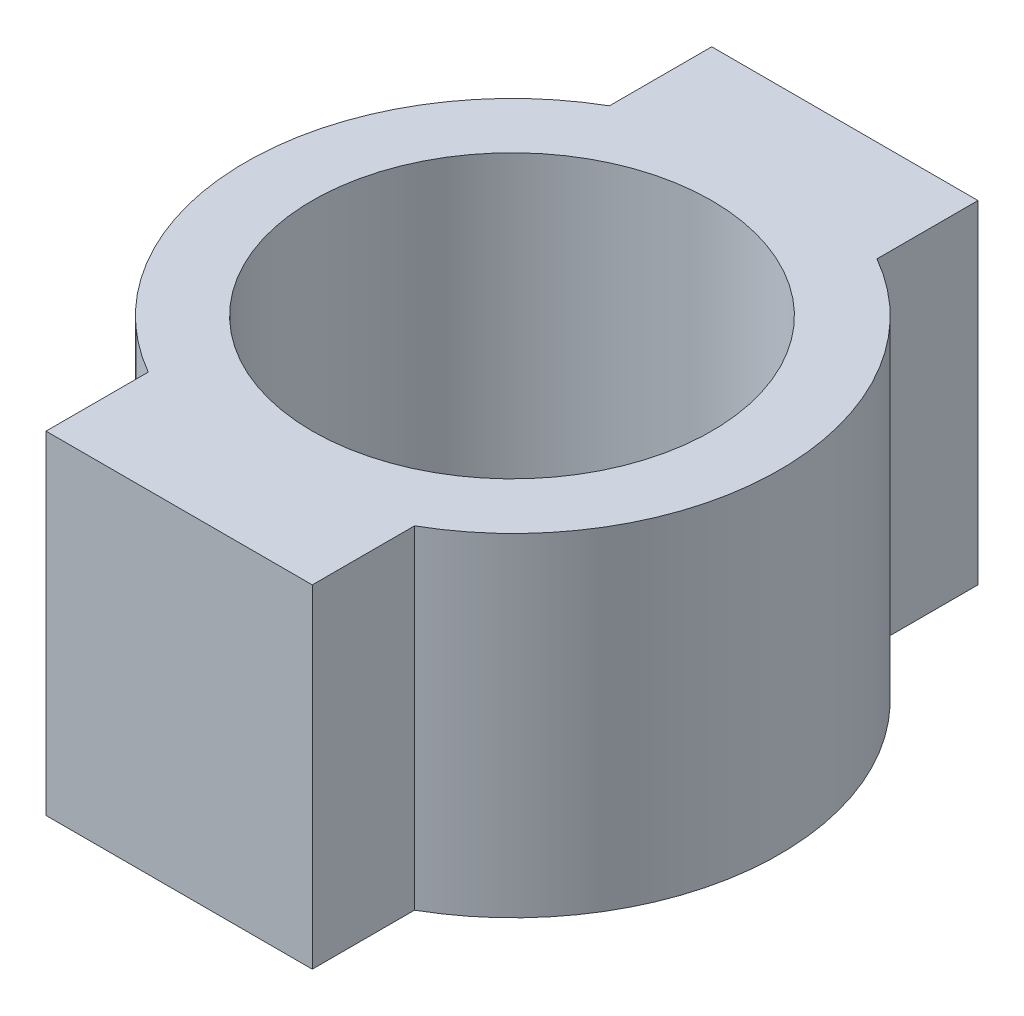
ISO-10303-21;
HEADER;
FILE_DESCRIPTION(('STEP AP214'),'2;1');
FILE_NAME('part.step','',(''),(''),'','','');
FILE_SCHEMA(('AUTOMOTIVE_DESIGN { 1 0 10303 214 1 1 1 1 }'));
ENDSEC;
DATA;
#1=APPLICATION_CONTEXT('core data for automotive mechanical design processes');
#2=APPLICATION_PROTOCOL_DEFINITION('international standard','automotive_design',2000,#1);
#3=PRODUCT_CONTEXT('',#1,'mechanical');
#4=PRODUCT('Part','Part','',(#3));
#5=PRODUCT_RELATED_PRODUCT_CATEGORY('part','',(#4));
#6=PRODUCT_DEFINITION_FORMATION('','',#4);
#7=PRODUCT_DEFINITION_CONTEXT('part definition',#1,'design');
#8=PRODUCT_DEFINITION('design','',#6,#7);
#9=PRODUCT_DEFINITION_SHAPE('','',#8);
#10=(LENGTH_UNIT() NAMED_UNIT(*) SI_UNIT(.MILLI.,.METRE.));
#11=(NAMED_UNIT(*) PLANE_ANGLE_UNIT() SI_UNIT($,.RADIAN.));
#12=(NAMED_UNIT(*) SI_UNIT($,.STERADIAN.) SOLID_ANGLE_UNIT());
#13=UNCERTAINTY_MEASURE_WITH_UNIT(LENGTH_MEASURE(1.E-05),#10,'distance_accuracy_value','');
#14=(GEOMETRIC_REPRESENTATION_CONTEXT(3) GLOBAL_UNCERTAINTY_ASSIGNED_CONTEXT((#13)) GLOBAL_UNIT_ASSIGNED_CONTEXT((#10,
#11,#12)) REPRESENTATION_CONTEXT('',''));
#15=CARTESIAN_POINT('',(0.,0.,0.));
#16=DIRECTION('',(0.,0.,1.));
#17=DIRECTION('',(1.,0.,0.));
#18=AXIS2_PLACEMENT_3D('',#15,#16,#17);
#19=CARTESIAN_POINT('',(20.,50.,-50.));
#20=DIRECTION('',(1.,0.,0.));
#21=DIRECTION('',(0.,0.,-1.));
#22=AXIS2_PLACEMENT_3D('',#19,#20,#21);
#23=PLANE('',#22);
#24=DIRECTION('',(0.,0.,1.));
#25=VECTOR('',#24,1.);
#26=CARTESIAN_POINT('',(20.,0.,-50.));
#27=LINE('',#26,#25);
#28=CARTESIAN_POINT('',(20.,0.,-50.));
#29=VERTEX_POINT('',#28);
#30=CARTESIAN_POINT('',(20.,0.,-34.8186230637616));
#31=VERTEX_POINT('',#30);
#32=EDGE_CURVE('E134',#29,#31,#27,.T.);
#33=ORIENTED_EDGE('',*,*,#32,.F.);
#34=DIRECTION('',(0.,-1.,0.));
#35=VECTOR('',#34,1.);
#36=CARTESIAN_POINT('',(20.,50.,-50.));
#37=LINE('',#36,#35);
#38=CARTESIAN_POINT('',(20.,50.,-50.));
#39=VERTEX_POINT('',#38);
#40=EDGE_CURVE('E11',#39,#29,#37,.T.);
#41=ORIENTED_EDGE('',*,*,#40,.F.);
#42=DIRECTION('',(0.,0.,1.));
#43=VECTOR('',#42,1.);
#44=CARTESIAN_POINT('',(20.,50.,-50.));
#45=LINE('',#44,#43);
#46=CARTESIAN_POINT('',(20.,50.,-34.8186230637616));
#47=VERTEX_POINT('',#46);
#48=EDGE_CURVE('E154',#39,#47,#45,.T.);
#49=ORIENTED_EDGE('',*,*,#48,.T.);
#50=DIRECTION('',(0.,-1.,0.));
#51=VECTOR('',#50,1.);
#52=CARTESIAN_POINT('',(20.,50.,-34.8186230637616));
#53=LINE('',#52,#51);
#54=EDGE_CURVE('E40',#47,#31,#53,.T.);
#55=ORIENTED_EDGE('',*,*,#54,.T.);
#56=EDGE_LOOP('',(#33,#41,#49,#55));
#57=FACE_BOUND('',#56,.T.);
#58=ADVANCED_FACE('F37',(#57),#23,.T.);
#59=CARTESIAN_POINT('',(-20.,50.,-50.));
#60=DIRECTION('',(0.,0.,-1.));
#61=DIRECTION('',(-1.,0.,0.));
#62=AXIS2_PLACEMENT_3D('',#59,#60,#61);
#63=PLANE('',#62);
#64=DIRECTION('',(1.,0.,0.));
#65=VECTOR('',#64,1.);
#66=CARTESIAN_POINT('',(-20.,0.,-50.));
#67=LINE('',#66,#65);
#68=CARTESIAN_POINT('',(-20.,0.,-50.));
#69=VERTEX_POINT('',#68);
#70=EDGE_CURVE('E152',#69,#29,#67,.T.);
#71=ORIENTED_EDGE('',*,*,#70,.F.);
#72=DIRECTION('',(0.,-1.,0.));
#73=VECTOR('',#72,1.);
#74=CARTESIAN_POINT('',(-20.,50.,-50.));
#75=LINE('',#74,#73);
#76=CARTESIAN_POINT('',(-20.,50.,-50.));
#77=VERTEX_POINT('',#76);
#78=EDGE_CURVE('E46',#77,#69,#75,.T.);
#79=ORIENTED_EDGE('',*,*,#78,.F.);
#80=DIRECTION('',(1.,0.,0.));
#81=VECTOR('',#80,1.);
#82=CARTESIAN_POINT('',(-20.,50.,-50.));
#83=LINE('',#82,#81);
#84=EDGE_CURVE('E114',#77,#39,#83,.T.);
#85=ORIENTED_EDGE('',*,*,#84,.T.);
#86=ORIENTED_EDGE('',*,*,#40,.T.);
#87=EDGE_LOOP('',(#71,#79,#85,#86));
#88=FACE_BOUND('',#87,.T.);
#89=ADVANCED_FACE('F168',(#88),#63,.T.);
#90=CARTESIAN_POINT('',(-20.,50.,-50.));
#91=DIRECTION('',(1.,0.,0.));
#92=DIRECTION('',(0.,0.,-1.));
#93=AXIS2_PLACEMENT_3D('',#90,#91,#92);
#94=PLANE('',#93);
#95=DIRECTION('',(0.,0.,1.));
#96=VECTOR('',#95,1.);
#97=CARTESIAN_POINT('',(-20.,0.,-50.));
#98=LINE('',#97,#96);
#99=CARTESIAN_POINT('',(-20.,0.,-34.6410161513776));
#100=VERTEX_POINT('',#99);
#101=EDGE_CURVE('E119',#69,#100,#98,.T.);
#102=ORIENTED_EDGE('',*,*,#101,.T.);
#103=DIRECTION('',(0.,-1.,0.));
#104=VECTOR('',#103,1.);
#105=CARTESIAN_POINT('',(-20.,50.,-34.6410161513776));
#106=LINE('',#105,#104);
#107=CARTESIAN_POINT('',(-20.,50.,-34.6410161513776));
#108=VERTEX_POINT('',#107);
#109=EDGE_CURVE('E117',#108,#100,#106,.T.);
#110=ORIENTED_EDGE('',*,*,#109,.F.);
#111=DIRECTION('',(0.,0.,1.));
#112=VECTOR('',#111,1.);
#113=CARTESIAN_POINT('',(-20.,50.,-50.));
#114=LINE('',#113,#112);
#115=EDGE_CURVE('E107',#77,#108,#114,.T.);
#116=ORIENTED_EDGE('',*,*,#115,.F.);
#117=ORIENTED_EDGE('',*,*,#78,.T.);
#118=EDGE_LOOP('',(#102,#110,#116,#117));
#119=FACE_BOUND('',#118,.T.);
#120=ADVANCED_FACE('F118',(#119),#94,.F.);
#121=CARTESIAN_POINT('',(0.,50.,0.));
#122=DIRECTION('',(0.,-1.,0.));
#123=DIRECTION('',(0.,0.,-1.));
#124=AXIS2_PLACEMENT_3D('',#121,#122,#123);
#125=CYLINDRICAL_SURFACE('',#124,40.);
#126=CARTESIAN_POINT('',(0.,0.,0.));
#127=DIRECTION('',(0.,1.,0.));
#128=DIRECTION('',(0.,0.,1.));
#129=AXIS2_PLACEMENT_3D('',#126,#127,#128);
#130=CIRCLE('',#129,40.);
#131=CARTESIAN_POINT('',(-20.,0.,34.6410161513775));
#132=VERTEX_POINT('',#131);
#133=EDGE_CURVE('E149',#100,#132,#130,.T.);
#134=ORIENTED_EDGE('',*,*,#133,.T.);
#135=DIRECTION('',(0.,-1.,0.));
#136=VECTOR('',#135,1.);
#137=CARTESIAN_POINT('',(-20.,50.,34.6410161513775));
#138=LINE('',#137,#136);
#139=CARTESIAN_POINT('',(-20.,50.,34.6410161513775));
#140=VERTEX_POINT('',#139);
#141=EDGE_CURVE('E123',#140,#132,#138,.T.);
#142=ORIENTED_EDGE('',*,*,#141,.F.);
#143=CARTESIAN_POINT('',(0.,50.,0.));
#144=DIRECTION('',(0.,1.,0.));
#145=DIRECTION('',(0.,0.,1.));
#146=AXIS2_PLACEMENT_3D('',#143,#144,#145);
#147=CIRCLE('',#146,40.);
#148=EDGE_CURVE('E112',#108,#140,#147,.T.);
#149=ORIENTED_EDGE('',*,*,#148,.F.);
#150=ORIENTED_EDGE('',*,*,#109,.T.);
#151=EDGE_LOOP('',(#134,#142,#149,#150));
#152=FACE_BOUND('',#151,.T.);
#153=ADVANCED_FACE('F125',(#152),#125,.T.);
#154=CARTESIAN_POINT('',(-20.,50.,50.));
#155=DIRECTION('',(-1.,0.,0.));
#156=DIRECTION('',(0.,0.,1.));
#157=AXIS2_PLACEMENT_3D('',#154,#155,#156);
#158=PLANE('',#157);
#159=DIRECTION('',(0.,0.,-1.));
#160=VECTOR('',#159,1.);
#161=CARTESIAN_POINT('',(-20.,0.,50.));
#162=LINE('',#161,#160);
#163=CARTESIAN_POINT('',(-20.,0.,50.));
#164=VERTEX_POINT('',#163);
#165=EDGE_CURVE('E146',#164,#132,#162,.T.);
#166=ORIENTED_EDGE('',*,*,#165,.F.);
#167=DIRECTION('',(0.,-1.,0.));
#168=VECTOR('',#167,1.);
#169=CARTESIAN_POINT('',(-20.,50.,50.));
#170=LINE('',#169,#168);
#171=CARTESIAN_POINT('',(-20.,50.,50.));
#172=VERTEX_POINT('',#171);
#173=EDGE_CURVE('E158',#172,#164,#170,.T.);
#174=ORIENTED_EDGE('',*,*,#173,.F.);
#175=DIRECTION('',(0.,0.,-1.));
#176=VECTOR('',#175,1.);
#177=CARTESIAN_POINT('',(-20.,50.,50.));
#178=LINE('',#177,#176);
#179=EDGE_CURVE('E127',#172,#140,#178,.T.);
#180=ORIENTED_EDGE('',*,*,#179,.T.);
#181=ORIENTED_EDGE('',*,*,#141,.T.);
#182=EDGE_LOOP('',(#166,#174,#180,#181));
#183=FACE_BOUND('',#182,.T.);
#184=ADVANCED_FACE('F181',(#183),#158,.T.);
#185=CARTESIAN_POINT('',(-20.,50.,50.));
#186=DIRECTION('',(0.,0.,-1.));
#187=DIRECTION('',(-1.,0.,0.));
#188=AXIS2_PLACEMENT_3D('',#185,#186,#187);
#189=PLANE('',#188);
#190=DIRECTION('',(1.,0.,0.));
#191=VECTOR('',#190,1.);
#192=CARTESIAN_POINT('',(-20.,0.,50.));
#193=LINE('',#192,#191);
#194=CARTESIAN_POINT('',(20.,0.,50.));
#195=VERTEX_POINT('',#194);
#196=EDGE_CURVE('E144',#164,#195,#193,.T.);
#197=ORIENTED_EDGE('',*,*,#196,.T.);
#198=DIRECTION('',(0.,-1.,0.));
#199=VECTOR('',#198,1.);
#200=CARTESIAN_POINT('',(20.,50.,50.));
#201=LINE('',#200,#199);
#202=CARTESIAN_POINT('',(20.,50.,50.));
#203=VERTEX_POINT('',#202);
#204=EDGE_CURVE('E160',#203,#195,#201,.T.);
#205=ORIENTED_EDGE('',*,*,#204,.F.);
#206=DIRECTION('',(1.,0.,0.));
#207=VECTOR('',#206,1.);
#208=CARTESIAN_POINT('',(-20.,50.,50.));
#209=LINE('',#208,#207);
#210=EDGE_CURVE('E129',#172,#203,#209,.T.);
#211=ORIENTED_EDGE('',*,*,#210,.F.);
#212=ORIENTED_EDGE('',*,*,#173,.T.);
#213=EDGE_LOOP('',(#197,#205,#211,#212));
#214=FACE_BOUND('',#213,.T.);
#215=ADVANCED_FACE('F184',(#214),#189,.F.);
#216=CARTESIAN_POINT('',(20.,50.,50.));
#217=DIRECTION('',(-1.,0.,0.));
#218=DIRECTION('',(0.,0.,1.));
#219=AXIS2_PLACEMENT_3D('',#216,#217,#218);
#220=PLANE('',#219);
#221=DIRECTION('',(0.,0.,-1.));
#222=VECTOR('',#221,1.);
#223=CARTESIAN_POINT('',(20.,0.,50.));
#224=LINE('',#223,#222);
#225=CARTESIAN_POINT('',(20.,0.,34.6410161513775));
#226=VERTEX_POINT('',#225);
#227=EDGE_CURVE('E141',#195,#226,#224,.T.);
#228=ORIENTED_EDGE('',*,*,#227,.T.);
#229=DIRECTION('',(0.,-1.,0.));
#230=VECTOR('',#229,1.);
#231=CARTESIAN_POINT('',(20.,50.,34.6410161513775));
#232=LINE('',#231,#230);
#233=CARTESIAN_POINT('',(20.,50.,34.6410161513775));
#234=VERTEX_POINT('',#233);
#235=EDGE_CURVE('E162',#234,#226,#232,.T.);
#236=ORIENTED_EDGE('',*,*,#235,.F.);
#237=DIRECTION('',(0.,0.,-1.));
#238=VECTOR('',#237,1.);
#239=CARTESIAN_POINT('',(20.,50.,50.));
#240=LINE('',#239,#238);
#241=EDGE_CURVE('E219',#203,#234,#240,.T.);
#242=ORIENTED_EDGE('',*,*,#241,.F.);
#243=ORIENTED_EDGE('',*,*,#204,.T.);
#244=EDGE_LOOP('',(#228,#236,#242,#243));
#245=FACE_BOUND('',#244,.T.);
#246=ADVANCED_FACE('F188',(#245),#220,.F.);
#247=CARTESIAN_POINT('',(0.154606831164215,50.,-0.0888034561920468));
#248=DIRECTION('',(0.,-1.,0.));
#249=DIRECTION('',(0.,0.,-1.));
#250=AXIS2_PLACEMENT_3D('',#247,#248,#249);
#251=CYLINDRICAL_SURFACE('',#250,40.);
#252=CARTESIAN_POINT('',(0.154606831164215,0.,-0.0888034561920468));
#253=DIRECTION('',(0.,-1.,0.));
#254=DIRECTION('',(0.,0.,-1.));
#255=AXIS2_PLACEMENT_3D('',#252,#253,#254);
#256=CIRCLE('',#255,40.);
#257=EDGE_CURVE('E137',#31,#226,#256,.T.);
#258=ORIENTED_EDGE('',*,*,#257,.F.);
#259=ORIENTED_EDGE('',*,*,#54,.F.);
#260=CARTESIAN_POINT('',(0.154606831164215,50.,-0.0888034561920468));
#261=DIRECTION('',(0.,-1.,0.));
#262=DIRECTION('',(0.,0.,-1.));
#263=AXIS2_PLACEMENT_3D('',#260,#261,#262);
#264=CIRCLE('',#263,40.);
#265=EDGE_CURVE('E217',#47,#234,#264,.T.);
#266=ORIENTED_EDGE('',*,*,#265,.T.);
#267=ORIENTED_EDGE('',*,*,#235,.T.);
#268=EDGE_LOOP('',(#258,#259,#266,#267));
#269=FACE_BOUND('',#268,.T.);
#270=ADVANCED_FACE('F164',(#269),#251,.T.);
#271=CARTESIAN_POINT('',(0.154606831164215,50.,-0.0888034561920468));
#272=DIRECTION('',(0.,-1.,0.));
#273=DIRECTION('',(0.,0.,-1.));
#274=AXIS2_PLACEMENT_3D('',#271,#272,#273);
#275=PLANE('',#274);
#276=CARTESIAN_POINT('',(0.,50.,0.));
#277=DIRECTION('',(0.,1.,0.));
#278=DIRECTION('',(0.,0.,1.));
#279=AXIS2_PLACEMENT_3D('',#276,#277,#278);
#280=CIRCLE('',#279,30.);
#281=CARTESIAN_POINT('',(0.,50.,30.));
#282=VERTEX_POINT('',#281);
#283=EDGE_CURVE('E212',#282,#282,#280,.T.);
#284=ORIENTED_EDGE('',*,*,#283,.F.);
#285=EDGE_LOOP('',(#284));
#286=FACE_BOUND('',#285,.T.);
#287=ORIENTED_EDGE('',*,*,#48,.F.);
#288=ORIENTED_EDGE('',*,*,#84,.F.);
#289=ORIENTED_EDGE('',*,*,#115,.T.);
#290=ORIENTED_EDGE('',*,*,#148,.T.);
#291=ORIENTED_EDGE('',*,*,#179,.F.);
#292=ORIENTED_EDGE('',*,*,#210,.T.);
#293=ORIENTED_EDGE('',*,*,#241,.T.);
#294=ORIENTED_EDGE('',*,*,#265,.F.);
#295=EDGE_LOOP('',(#287,#288,#289,#290,#291,#292,#293,#294));
#296=FACE_BOUND('',#295,.T.);
#297=ADVANCED_FACE('F109',(#286,#296),#275,.F.);
#298=CARTESIAN_POINT('',(0.154606831164215,0.,-0.0888034561920468));
#299=DIRECTION('',(0.,-1.,0.));
#300=DIRECTION('',(0.,0.,-1.));
#301=AXIS2_PLACEMENT_3D('',#298,#299,#300);
#302=PLANE('',#301);
#303=CARTESIAN_POINT('',(0.,0.,0.));
#304=DIRECTION('',(0.,1.,0.));
#305=DIRECTION('',(0.,0.,1.));
#306=AXIS2_PLACEMENT_3D('',#303,#304,#305);
#307=CIRCLE('',#306,30.);
#308=CARTESIAN_POINT('',(0.,0.,30.));
#309=VERTEX_POINT('',#308);
#310=EDGE_CURVE('E138',#309,#309,#307,.T.);
#311=ORIENTED_EDGE('',*,*,#310,.T.);
#312=EDGE_LOOP('',(#311));
#313=FACE_BOUND('',#312,.T.);
#314=ORIENTED_EDGE('',*,*,#32,.T.);
#315=ORIENTED_EDGE('',*,*,#257,.T.);
#316=ORIENTED_EDGE('',*,*,#227,.F.);
#317=ORIENTED_EDGE('',*,*,#196,.F.);
#318=ORIENTED_EDGE('',*,*,#165,.T.);
#319=ORIENTED_EDGE('',*,*,#133,.F.);
#320=ORIENTED_EDGE('',*,*,#101,.F.);
#321=ORIENTED_EDGE('',*,*,#70,.T.);
#322=EDGE_LOOP('',(#314,#315,#316,#317,#318,#319,#320,#321));
#323=FACE_BOUND('',#322,.T.);
#324=ADVANCED_FACE('F167',(#313,#323),#302,.T.);
#325=CARTESIAN_POINT('',(0.,0.,0.));
#326=DIRECTION('',(0.,1.,0.));
#327=DIRECTION('',(0.,0.,1.));
#328=AXIS2_PLACEMENT_3D('',#325,#326,#327);
#329=CYLINDRICAL_SURFACE('',#328,30.);
#330=ORIENTED_EDGE('',*,*,#310,.F.);
#331=EDGE_LOOP('',(#330));
#332=FACE_BOUND('',#331,.T.);
#333=ORIENTED_EDGE('',*,*,#283,.T.);
#334=EDGE_LOOP('',(#333));
#335=FACE_BOUND('',#334,.T.);
#336=ADVANCED_FACE('F200',(#332,#335),#329,.F.);
#337=CLOSED_SHELL('',(#58,#89,#120,#153,#184,#215,#246,#270,#297,#324,#336));
#338=MANIFOLD_SOLID_BREP('B2',#337);
#339=ADVANCED_BREP_SHAPE_REPRESENTATION('',(#18,#338),#14);
#340=SHAPE_DEFINITION_REPRESENTATION(#9,#339);
ENDSEC;
END-ISO-10303-21;
